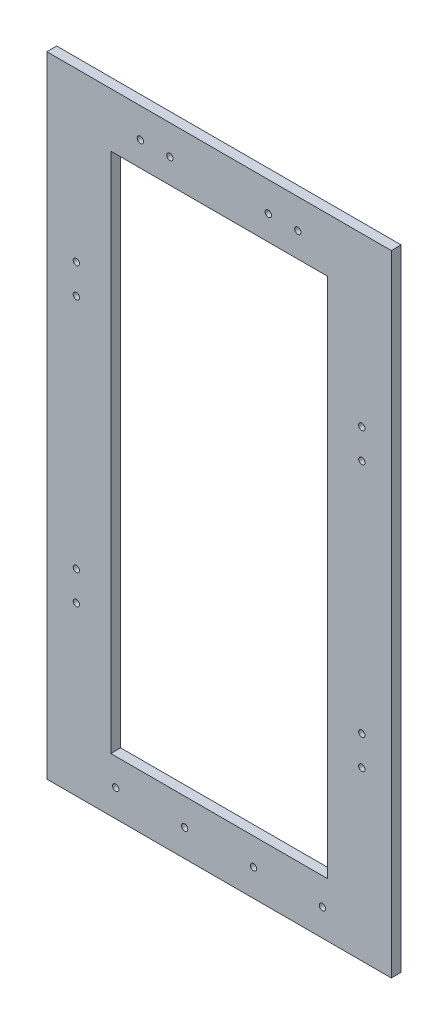
ISO-10303-21;
HEADER;
FILE_DESCRIPTION(('STEP AP214'),'2;1');
FILE_NAME('part.step','',(''),(''),'','','');
FILE_SCHEMA(('AUTOMOTIVE_DESIGN { 1 0 10303 214 1 1 1 1 }'));
ENDSEC;
DATA;
#1=APPLICATION_CONTEXT('core data for automotive mechanical design processes');
#2=APPLICATION_PROTOCOL_DEFINITION('international standard','automotive_design',2000,#1);
#3=PRODUCT_CONTEXT('',#1,'mechanical');
#4=PRODUCT('Part','Part','',(#3));
#5=PRODUCT_RELATED_PRODUCT_CATEGORY('part','',(#4));
#6=PRODUCT_DEFINITION_FORMATION('','',#4);
#7=PRODUCT_DEFINITION_CONTEXT('part definition',#1,'design');
#8=PRODUCT_DEFINITION('design','',#6,#7);
#9=PRODUCT_DEFINITION_SHAPE('','',#8);
#10=(LENGTH_UNIT() NAMED_UNIT(*) SI_UNIT(.MILLI.,.METRE.));
#11=(NAMED_UNIT(*) PLANE_ANGLE_UNIT() SI_UNIT($,.RADIAN.));
#12=(NAMED_UNIT(*) SI_UNIT($,.STERADIAN.) SOLID_ANGLE_UNIT());
#13=UNCERTAINTY_MEASURE_WITH_UNIT(LENGTH_MEASURE(1.E-05),#10,'distance_accuracy_value','');
#14=(GEOMETRIC_REPRESENTATION_CONTEXT(3) GLOBAL_UNCERTAINTY_ASSIGNED_CONTEXT((#13)) GLOBAL_UNIT_ASSIGNED_CONTEXT((#10,
#11,#12)) REPRESENTATION_CONTEXT('',''));
#15=CARTESIAN_POINT('',(0.,0.,0.));
#16=DIRECTION('',(0.,0.,1.));
#17=DIRECTION('',(1.,0.,0.));
#18=AXIS2_PLACEMENT_3D('',#15,#16,#17);
#19=CARTESIAN_POINT('',(87.5,-160.,5.));
#20=DIRECTION('',(-1.,0.,0.));
#21=DIRECTION('',(0.,0.,1.));
#22=AXIS2_PLACEMENT_3D('',#19,#20,#21);
#23=PLANE('',#22);
#24=DIRECTION('',(0.,1.,0.));
#25=VECTOR('',#24,1.);
#26=CARTESIAN_POINT('',(87.5,-160.,0.));
#27=LINE('',#26,#25);
#28=CARTESIAN_POINT('',(87.5,-160.,0.));
#29=VERTEX_POINT('',#28);
#30=CARTESIAN_POINT('',(87.5,160.,0.));
#31=VERTEX_POINT('',#30);
#32=EDGE_CURVE('E113',#29,#31,#27,.T.);
#33=ORIENTED_EDGE('',*,*,#32,.T.);
#34=DIRECTION('',(0.,0.,-1.));
#35=VECTOR('',#34,1.);
#36=CARTESIAN_POINT('',(87.5,160.,5.));
#37=LINE('',#36,#35);
#38=CARTESIAN_POINT('',(87.5,160.,5.));
#39=VERTEX_POINT('',#38);
#40=EDGE_CURVE('E11',#39,#31,#37,.T.);
#41=ORIENTED_EDGE('',*,*,#40,.F.);
#42=DIRECTION('',(0.,1.,0.));
#43=VECTOR('',#42,1.);
#44=CARTESIAN_POINT('',(87.5,-160.,5.));
#45=LINE('',#44,#43);
#46=CARTESIAN_POINT('',(87.5,-160.,5.));
#47=VERTEX_POINT('',#46);
#48=EDGE_CURVE('E136',#47,#39,#45,.T.);
#49=ORIENTED_EDGE('',*,*,#48,.F.);
#50=DIRECTION('',(0.,0.,-1.));
#51=VECTOR('',#50,1.);
#52=CARTESIAN_POINT('',(87.5,-160.,5.));
#53=LINE('',#52,#51);
#54=EDGE_CURVE('E146',#47,#29,#53,.T.);
#55=ORIENTED_EDGE('',*,*,#54,.T.);
#56=EDGE_LOOP('',(#33,#41,#49,#55));
#57=FACE_BOUND('',#56,.T.);
#58=ADVANCED_FACE('F33',(#57),#23,.F.);
#59=CARTESIAN_POINT('',(-87.5,160.,5.));
#60=DIRECTION('',(0.,-1.,0.));
#61=DIRECTION('',(0.,0.,-1.));
#62=AXIS2_PLACEMENT_3D('',#59,#60,#61);
#63=PLANE('',#62);
#64=DIRECTION('',(-1.,0.,0.));
#65=VECTOR('',#64,1.);
#66=CARTESIAN_POINT('',(-87.5,160.,0.));
#67=LINE('',#66,#65);
#68=CARTESIAN_POINT('',(-87.5,160.,0.));
#69=VERTEX_POINT('',#68);
#70=EDGE_CURVE('E149',#31,#69,#67,.T.);
#71=ORIENTED_EDGE('',*,*,#70,.T.);
#72=DIRECTION('',(0.,0.,-1.));
#73=VECTOR('',#72,1.);
#74=CARTESIAN_POINT('',(-87.5,160.,5.));
#75=LINE('',#74,#73);
#76=CARTESIAN_POINT('',(-87.5,160.,5.));
#77=VERTEX_POINT('',#76);
#78=EDGE_CURVE('E41',#77,#69,#75,.T.);
#79=ORIENTED_EDGE('',*,*,#78,.F.);
#80=DIRECTION('',(-1.,0.,0.));
#81=VECTOR('',#80,1.);
#82=CARTESIAN_POINT('',(-87.5,160.,5.));
#83=LINE('',#82,#81);
#84=EDGE_CURVE('E139',#39,#77,#83,.T.);
#85=ORIENTED_EDGE('',*,*,#84,.F.);
#86=ORIENTED_EDGE('',*,*,#40,.T.);
#87=EDGE_LOOP('',(#71,#79,#85,#86));
#88=FACE_BOUND('',#87,.T.);
#89=ADVANCED_FACE('F263',(#88),#63,.F.);
#90=CARTESIAN_POINT('',(-87.5,-160.,5.));
#91=DIRECTION('',(1.,0.,0.));
#92=DIRECTION('',(0.,0.,-1.));
#93=AXIS2_PLACEMENT_3D('',#90,#91,#92);
#94=PLANE('',#93);
#95=DIRECTION('',(0.,-1.,0.));
#96=VECTOR('',#95,1.);
#97=CARTESIAN_POINT('',(-87.5,-160.,0.));
#98=LINE('',#97,#96);
#99=CARTESIAN_POINT('',(-87.5,-160.,0.));
#100=VERTEX_POINT('',#99);
#101=EDGE_CURVE('E151',#69,#100,#98,.T.);
#102=ORIENTED_EDGE('',*,*,#101,.T.);
#103=DIRECTION('',(0.,0.,-1.));
#104=VECTOR('',#103,1.);
#105=CARTESIAN_POINT('',(-87.5,-160.,5.));
#106=LINE('',#105,#104);
#107=CARTESIAN_POINT('',(-87.5,-160.,5.));
#108=VERTEX_POINT('',#107);
#109=EDGE_CURVE('E156',#108,#100,#106,.T.);
#110=ORIENTED_EDGE('',*,*,#109,.F.);
#111=DIRECTION('',(0.,-1.,0.));
#112=VECTOR('',#111,1.);
#113=CARTESIAN_POINT('',(-87.5,-160.,5.));
#114=LINE('',#113,#112);
#115=EDGE_CURVE('E142',#77,#108,#114,.T.);
#116=ORIENTED_EDGE('',*,*,#115,.F.);
#117=ORIENTED_EDGE('',*,*,#78,.T.);
#118=EDGE_LOOP('',(#102,#110,#116,#117));
#119=FACE_BOUND('',#118,.T.);
#120=ADVANCED_FACE('F256',(#119),#94,.F.);
#121=CARTESIAN_POINT('',(-87.5,-160.,5.));
#122=DIRECTION('',(0.,1.,0.));
#123=DIRECTION('',(0.,0.,1.));
#124=AXIS2_PLACEMENT_3D('',#121,#122,#123);
#125=PLANE('',#124);
#126=DIRECTION('',(1.,0.,0.));
#127=VECTOR('',#126,1.);
#128=CARTESIAN_POINT('',(-87.5,-160.,0.));
#129=LINE('',#128,#127);
#130=EDGE_CURVE('E140',#100,#29,#129,.T.);
#131=ORIENTED_EDGE('',*,*,#130,.T.);
#132=ORIENTED_EDGE('',*,*,#54,.F.);
#133=DIRECTION('',(1.,0.,0.));
#134=VECTOR('',#133,1.);
#135=CARTESIAN_POINT('',(-87.5,-160.,5.));
#136=LINE('',#135,#134);
#137=EDGE_CURVE('E144',#108,#47,#136,.T.);
#138=ORIENTED_EDGE('',*,*,#137,.F.);
#139=ORIENTED_EDGE('',*,*,#109,.T.);
#140=EDGE_LOOP('',(#131,#132,#138,#139));
#141=FACE_BOUND('',#140,.T.);
#142=ADVANCED_FACE('F247',(#141),#125,.F.);
#143=CARTESIAN_POINT('',(0.,0.,5.));
#144=DIRECTION('',(0.,0.,-1.));
#145=DIRECTION('',(-1.,0.,0.));
#146=AXIS2_PLACEMENT_3D('',#143,#144,#145);
#147=PLANE('',#146);
#148=CARTESIAN_POINT('',(-52.5,-146.25,5.));
#149=DIRECTION('',(0.,0.,-1.));
#150=DIRECTION('',(-1.,0.,0.));
#151=AXIS2_PLACEMENT_3D('',#148,#149,#150);
#152=CIRCLE('',#151,1.6);
#153=CARTESIAN_POINT('',(-54.1,-146.25,5.));
#154=VERTEX_POINT('',#153);
#155=EDGE_CURVE('E165',#154,#154,#152,.F.);
#156=ORIENTED_EDGE('',*,*,#155,.F.);
#157=EDGE_LOOP('',(#156));
#158=FACE_BOUND('',#157,.T.);
#159=CARTESIAN_POINT('',(-17.5,-146.25,5.));
#160=DIRECTION('',(0.,0.,-1.));
#161=DIRECTION('',(-1.,0.,0.));
#162=AXIS2_PLACEMENT_3D('',#159,#160,#161);
#163=CIRCLE('',#162,1.6);
#164=CARTESIAN_POINT('',(-19.1,-146.25,5.));
#165=VERTEX_POINT('',#164);
#166=EDGE_CURVE('E496',#165,#165,#163,.F.);
#167=ORIENTED_EDGE('',*,*,#166,.F.);
#168=EDGE_LOOP('',(#167));
#169=FACE_BOUND('',#168,.T.);
#170=CARTESIAN_POINT('',(17.5,-146.250000000001,5.));
#171=DIRECTION('',(0.,0.,-1.));
#172=DIRECTION('',(-1.,0.,0.));
#173=AXIS2_PLACEMENT_3D('',#170,#171,#172);
#174=CIRCLE('',#173,1.6);
#175=CARTESIAN_POINT('',(15.9,-146.250000000001,5.));
#176=VERTEX_POINT('',#175);
#177=EDGE_CURVE('E499',#176,#176,#174,.F.);
#178=ORIENTED_EDGE('',*,*,#177,.F.);
#179=EDGE_LOOP('',(#178));
#180=FACE_BOUND('',#179,.T.);
#181=CARTESIAN_POINT('',(52.5,-146.250000000001,5.));
#182=DIRECTION('',(0.,0.,-1.));
#183=DIRECTION('',(-1.,0.,0.));
#184=AXIS2_PLACEMENT_3D('',#181,#182,#183);
#185=CIRCLE('',#184,1.6);
#186=CARTESIAN_POINT('',(50.9,-146.250000000001,5.));
#187=VERTEX_POINT('',#186);
#188=EDGE_CURVE('E504',#187,#187,#185,.F.);
#189=ORIENTED_EDGE('',*,*,#188,.F.);
#190=EDGE_LOOP('',(#189));
#191=FACE_BOUND('',#190,.T.);
#192=CARTESIAN_POINT('',(-72.5,-75.,5.));
#193=DIRECTION('',(0.,0.,-1.));
#194=DIRECTION('',(-1.,0.,0.));
#195=AXIS2_PLACEMENT_3D('',#192,#193,#194);
#196=CIRCLE('',#195,1.60000000000001);
#197=CARTESIAN_POINT('',(-74.1,-75.,5.));
#198=VERTEX_POINT('',#197);
#199=EDGE_CURVE('E191',#198,#198,#196,.F.);
#200=ORIENTED_EDGE('',*,*,#199,.F.);
#201=EDGE_LOOP('',(#200));
#202=FACE_BOUND('',#201,.T.);
#203=CARTESIAN_POINT('',(72.5,-60.,5.));
#204=DIRECTION('',(0.,0.,-1.));
#205=DIRECTION('',(-1.,0.,0.));
#206=AXIS2_PLACEMENT_3D('',#203,#204,#205);
#207=CIRCLE('',#206,1.60000000000001);
#208=CARTESIAN_POINT('',(70.9,-60.,5.));
#209=VERTEX_POINT('',#208);
#210=EDGE_CURVE('E190',#209,#209,#207,.F.);
#211=ORIENTED_EDGE('',*,*,#210,.F.);
#212=EDGE_LOOP('',(#211));
#213=FACE_BOUND('',#212,.T.);
#214=CARTESIAN_POINT('',(72.5,-75.,5.));
#215=DIRECTION('',(0.,0.,-1.));
#216=DIRECTION('',(-1.,0.,0.));
#217=AXIS2_PLACEMENT_3D('',#214,#215,#216);
#218=CIRCLE('',#217,1.60000000000001);
#219=CARTESIAN_POINT('',(70.9,-75.,5.));
#220=VERTEX_POINT('',#219);
#221=EDGE_CURVE('E205',#220,#220,#218,.F.);
#222=ORIENTED_EDGE('',*,*,#221,.F.);
#223=EDGE_LOOP('',(#222));
#224=FACE_BOUND('',#223,.T.);
#225=CARTESIAN_POINT('',(72.5,60.,5.));
#226=DIRECTION('',(0.,0.,-1.));
#227=DIRECTION('',(-1.,0.,0.));
#228=AXIS2_PLACEMENT_3D('',#225,#226,#227);
#229=CIRCLE('',#228,1.60000000000001);
#230=CARTESIAN_POINT('',(70.9,60.,5.));
#231=VERTEX_POINT('',#230);
#232=EDGE_CURVE('E204',#231,#231,#229,.F.);
#233=ORIENTED_EDGE('',*,*,#232,.F.);
#234=EDGE_LOOP('',(#233));
#235=FACE_BOUND('',#234,.T.);
#236=CARTESIAN_POINT('',(-72.5,-60.,5.));
#237=DIRECTION('',(0.,0.,-1.));
#238=DIRECTION('',(-1.,0.,0.));
#239=AXIS2_PLACEMENT_3D('',#236,#237,#238);
#240=CIRCLE('',#239,1.60000000000001);
#241=CARTESIAN_POINT('',(-74.1,-60.,5.));
#242=VERTEX_POINT('',#241);
#243=EDGE_CURVE('E198',#242,#242,#240,.F.);
#244=ORIENTED_EDGE('',*,*,#243,.F.);
#245=EDGE_LOOP('',(#244));
#246=FACE_BOUND('',#245,.T.);
#247=CARTESIAN_POINT('',(-72.5,60.,5.));
#248=DIRECTION('',(0.,0.,-1.));
#249=DIRECTION('',(-1.,0.,0.));
#250=AXIS2_PLACEMENT_3D('',#247,#248,#249);
#251=CIRCLE('',#250,1.60000000000001);
#252=CARTESIAN_POINT('',(-74.1,60.,5.));
#253=VERTEX_POINT('',#252);
#254=EDGE_CURVE('E184',#253,#253,#251,.F.);
#255=ORIENTED_EDGE('',*,*,#254,.F.);
#256=EDGE_LOOP('',(#255));
#257=FACE_BOUND('',#256,.T.);
#258=CARTESIAN_POINT('',(-72.5,75.,5.));
#259=DIRECTION('',(0.,0.,-1.));
#260=DIRECTION('',(-1.,0.,0.));
#261=AXIS2_PLACEMENT_3D('',#258,#259,#260);
#262=CIRCLE('',#261,1.60000000000001);
#263=CARTESIAN_POINT('',(-74.1,75.,5.));
#264=VERTEX_POINT('',#263);
#265=EDGE_CURVE('E176',#264,#264,#262,.F.);
#266=ORIENTED_EDGE('',*,*,#265,.F.);
#267=EDGE_LOOP('',(#266));
#268=FACE_BOUND('',#267,.T.);
#269=CARTESIAN_POINT('',(72.5,75.,5.));
#270=DIRECTION('',(0.,0.,-1.));
#271=DIRECTION('',(-1.,0.,0.));
#272=AXIS2_PLACEMENT_3D('',#269,#270,#271);
#273=CIRCLE('',#272,1.60000000000001);
#274=CARTESIAN_POINT('',(70.9,75.,5.));
#275=VERTEX_POINT('',#274);
#276=EDGE_CURVE('E215',#275,#275,#273,.F.);
#277=ORIENTED_EDGE('',*,*,#276,.F.);
#278=EDGE_LOOP('',(#277));
#279=FACE_BOUND('',#278,.T.);
#280=CARTESIAN_POINT('',(-40.,145.,5.));
#281=DIRECTION('',(0.,0.,-1.));
#282=DIRECTION('',(-1.,0.,0.));
#283=AXIS2_PLACEMENT_3D('',#280,#281,#282);
#284=CIRCLE('',#283,1.6);
#285=CARTESIAN_POINT('',(-41.6,145.,5.));
#286=VERTEX_POINT('',#285);
#287=EDGE_CURVE('E230',#286,#286,#284,.F.);
#288=ORIENTED_EDGE('',*,*,#287,.F.);
#289=EDGE_LOOP('',(#288));
#290=FACE_BOUND('',#289,.T.);
#291=CARTESIAN_POINT('',(-25.,145.,5.));
#292=DIRECTION('',(0.,0.,-1.));
#293=DIRECTION('',(-1.,0.,0.));
#294=AXIS2_PLACEMENT_3D('',#291,#292,#293);
#295=CIRCLE('',#294,1.60000000000001);
#296=CARTESIAN_POINT('',(-26.6,145.,5.));
#297=VERTEX_POINT('',#296);
#298=EDGE_CURVE('E223',#297,#297,#295,.F.);
#299=ORIENTED_EDGE('',*,*,#298,.F.);
#300=EDGE_LOOP('',(#299));
#301=FACE_BOUND('',#300,.T.);
#302=CARTESIAN_POINT('',(40.,145.,5.));
#303=DIRECTION('',(0.,0.,-1.));
#304=DIRECTION('',(-1.,0.,0.));
#305=AXIS2_PLACEMENT_3D('',#302,#303,#304);
#306=CIRCLE('',#305,1.6);
#307=CARTESIAN_POINT('',(38.4,145.,5.));
#308=VERTEX_POINT('',#307);
#309=EDGE_CURVE('E222',#308,#308,#306,.F.);
#310=ORIENTED_EDGE('',*,*,#309,.F.);
#311=EDGE_LOOP('',(#310));
#312=FACE_BOUND('',#311,.T.);
#313=CARTESIAN_POINT('',(25.,145.,5.));
#314=DIRECTION('',(0.,0.,-1.));
#315=DIRECTION('',(-1.,0.,0.));
#316=AXIS2_PLACEMENT_3D('',#313,#314,#315);
#317=CIRCLE('',#316,1.6);
#318=CARTESIAN_POINT('',(23.4,145.,5.));
#319=VERTEX_POINT('',#318);
#320=EDGE_CURVE('E239',#319,#319,#317,.F.);
#321=ORIENTED_EDGE('',*,*,#320,.F.);
#322=EDGE_LOOP('',(#321));
#323=FACE_BOUND('',#322,.T.);
#324=DIRECTION('',(-1.,0.,0.));
#325=VECTOR('',#324,1.);
#326=CARTESIAN_POINT('',(-55.,132.5,5.));
#327=LINE('',#326,#325);
#328=CARTESIAN_POINT('',(55.,132.5,5.));
#329=VERTEX_POINT('',#328);
#330=CARTESIAN_POINT('',(-55.,132.5,5.));
#331=VERTEX_POINT('',#330);
#332=EDGE_CURVE('E119',#329,#331,#327,.T.);
#333=ORIENTED_EDGE('',*,*,#332,.F.);
#334=DIRECTION('',(0.,1.,0.));
#335=VECTOR('',#334,1.);
#336=CARTESIAN_POINT('',(55.,-132.5,5.));
#337=LINE('',#336,#335);
#338=CARTESIAN_POINT('',(55.,-132.5,5.));
#339=VERTEX_POINT('',#338);
#340=EDGE_CURVE('E101',#339,#329,#337,.T.);
#341=ORIENTED_EDGE('',*,*,#340,.F.);
#342=DIRECTION('',(1.,0.,0.));
#343=VECTOR('',#342,1.);
#344=CARTESIAN_POINT('',(-55.,-132.5,5.));
#345=LINE('',#344,#343);
#346=CARTESIAN_POINT('',(-55.,-132.5,5.));
#347=VERTEX_POINT('',#346);
#348=EDGE_CURVE('E110',#347,#339,#345,.T.);
#349=ORIENTED_EDGE('',*,*,#348,.F.);
#350=DIRECTION('',(0.,-1.,0.));
#351=VECTOR('',#350,1.);
#352=CARTESIAN_POINT('',(-55.,-132.5,5.));
#353=LINE('',#352,#351);
#354=EDGE_CURVE('E49',#331,#347,#353,.T.);
#355=ORIENTED_EDGE('',*,*,#354,.F.);
#356=EDGE_LOOP('',(#333,#341,#349,#355));
#357=FACE_BOUND('',#356,.T.);
#358=ORIENTED_EDGE('',*,*,#48,.T.);
#359=ORIENTED_EDGE('',*,*,#84,.T.);
#360=ORIENTED_EDGE('',*,*,#115,.T.);
#361=ORIENTED_EDGE('',*,*,#137,.T.);
#362=EDGE_LOOP('',(#358,#359,#360,#361));
#363=FACE_BOUND('',#362,.T.);
#364=ADVANCED_FACE('F116',(#158,#169,#180,#191,#202,#213,#224,#235,#246,#257,#268,#279,#290,
#301,#312,#323,#357,#363),#147,.F.);
#365=CARTESIAN_POINT('',(0.,0.,0.));
#366=DIRECTION('',(0.,0.,-1.));
#367=DIRECTION('',(-1.,0.,0.));
#368=AXIS2_PLACEMENT_3D('',#365,#366,#367);
#369=PLANE('',#368);
#370=CARTESIAN_POINT('',(-52.5,-146.25,0.));
#371=DIRECTION('',(0.,0.,-1.));
#372=DIRECTION('',(-1.,0.,0.));
#373=AXIS2_PLACEMENT_3D('',#370,#371,#372);
#374=CIRCLE('',#373,1.6);
#375=CARTESIAN_POINT('',(-54.1,-146.25,0.));
#376=VERTEX_POINT('',#375);
#377=EDGE_CURVE('E36',#376,#376,#374,.F.);
#378=ORIENTED_EDGE('',*,*,#377,.T.);
#379=EDGE_LOOP('',(#378));
#380=FACE_BOUND('',#379,.T.);
#381=CARTESIAN_POINT('',(-17.5,-146.25,0.));
#382=DIRECTION('',(0.,0.,-1.));
#383=DIRECTION('',(-1.,0.,0.));
#384=AXIS2_PLACEMENT_3D('',#381,#382,#383);
#385=CIRCLE('',#384,1.6);
#386=CARTESIAN_POINT('',(-19.1,-146.25,0.));
#387=VERTEX_POINT('',#386);
#388=EDGE_CURVE('E167',#387,#387,#385,.F.);
#389=ORIENTED_EDGE('',*,*,#388,.T.);
#390=EDGE_LOOP('',(#389));
#391=FACE_BOUND('',#390,.T.);
#392=CARTESIAN_POINT('',(17.5,-146.250000000001,0.));
#393=DIRECTION('',(0.,0.,-1.));
#394=DIRECTION('',(-1.,0.,0.));
#395=AXIS2_PLACEMENT_3D('',#392,#393,#394);
#396=CIRCLE('',#395,1.6);
#397=CARTESIAN_POINT('',(15.9,-146.250000000001,0.));
#398=VERTEX_POINT('',#397);
#399=EDGE_CURVE('E164',#398,#398,#396,.F.);
#400=ORIENTED_EDGE('',*,*,#399,.T.);
#401=EDGE_LOOP('',(#400));
#402=FACE_BOUND('',#401,.T.);
#403=CARTESIAN_POINT('',(52.5,-146.250000000001,0.));
#404=DIRECTION('',(0.,0.,-1.));
#405=DIRECTION('',(-1.,0.,0.));
#406=AXIS2_PLACEMENT_3D('',#403,#404,#405);
#407=CIRCLE('',#406,1.6);
#408=CARTESIAN_POINT('',(50.9,-146.250000000001,0.));
#409=VERTEX_POINT('',#408);
#410=EDGE_CURVE('E161',#409,#409,#407,.F.);
#411=ORIENTED_EDGE('',*,*,#410,.T.);
#412=EDGE_LOOP('',(#411));
#413=FACE_BOUND('',#412,.T.);
#414=CARTESIAN_POINT('',(-72.5,-75.,0.));
#415=DIRECTION('',(0.,0.,-1.));
#416=DIRECTION('',(-1.,0.,0.));
#417=AXIS2_PLACEMENT_3D('',#414,#415,#416);
#418=CIRCLE('',#417,1.60000000000001);
#419=CARTESIAN_POINT('',(-74.1,-75.,0.));
#420=VERTEX_POINT('',#419);
#421=EDGE_CURVE('E195',#420,#420,#418,.T.);
#422=ORIENTED_EDGE('',*,*,#421,.F.);
#423=EDGE_LOOP('',(#422));
#424=FACE_BOUND('',#423,.T.);
#425=CARTESIAN_POINT('',(72.5,-60.,0.));
#426=DIRECTION('',(0.,0.,-1.));
#427=DIRECTION('',(1.,0.,0.));
#428=AXIS2_PLACEMENT_3D('',#425,#426,#427);
#429=CIRCLE('',#428,1.60000000000001);
#430=CARTESIAN_POINT('',(74.1,-60.,0.));
#431=VERTEX_POINT('',#430);
#432=EDGE_CURVE('E187',#431,#431,#429,.T.);
#433=ORIENTED_EDGE('',*,*,#432,.F.);
#434=EDGE_LOOP('',(#433));
#435=FACE_BOUND('',#434,.T.);
#436=CARTESIAN_POINT('',(72.5,-75.,0.));
#437=DIRECTION('',(0.,0.,-1.));
#438=DIRECTION('',(1.,0.,0.));
#439=AXIS2_PLACEMENT_3D('',#436,#437,#438);
#440=CIRCLE('',#439,1.60000000000001);
#441=CARTESIAN_POINT('',(74.1,-75.,0.));
#442=VERTEX_POINT('',#441);
#443=EDGE_CURVE('E194',#442,#442,#440,.T.);
#444=ORIENTED_EDGE('',*,*,#443,.F.);
#445=EDGE_LOOP('',(#444));
#446=FACE_BOUND('',#445,.T.);
#447=CARTESIAN_POINT('',(72.5,60.,0.));
#448=DIRECTION('',(0.,0.,-1.));
#449=DIRECTION('',(-1.,0.,0.));
#450=AXIS2_PLACEMENT_3D('',#447,#448,#449);
#451=CIRCLE('',#450,1.60000000000001);
#452=CARTESIAN_POINT('',(70.9,60.,0.));
#453=VERTEX_POINT('',#452);
#454=EDGE_CURVE('E201',#453,#453,#451,.T.);
#455=ORIENTED_EDGE('',*,*,#454,.F.);
#456=EDGE_LOOP('',(#455));
#457=FACE_BOUND('',#456,.T.);
#458=CARTESIAN_POINT('',(-72.5,-60.,0.));
#459=DIRECTION('',(0.,0.,-1.));
#460=DIRECTION('',(-1.,0.,0.));
#461=AXIS2_PLACEMENT_3D('',#458,#459,#460);
#462=CIRCLE('',#461,1.60000000000001);
#463=CARTESIAN_POINT('',(-74.1,-60.,0.));
#464=VERTEX_POINT('',#463);
#465=EDGE_CURVE('E507',#464,#464,#462,.T.);
#466=ORIENTED_EDGE('',*,*,#465,.F.);
#467=EDGE_LOOP('',(#466));
#468=FACE_BOUND('',#467,.T.);
#469=CARTESIAN_POINT('',(-72.5,60.,0.));
#470=DIRECTION('',(0.,0.,-1.));
#471=DIRECTION('',(1.,0.,0.));
#472=AXIS2_PLACEMENT_3D('',#469,#470,#471);
#473=CIRCLE('',#472,1.60000000000001);
#474=CARTESIAN_POINT('',(-70.9,60.,0.));
#475=VERTEX_POINT('',#474);
#476=EDGE_CURVE('E181',#475,#475,#473,.T.);
#477=ORIENTED_EDGE('',*,*,#476,.F.);
#478=EDGE_LOOP('',(#477));
#479=FACE_BOUND('',#478,.T.);
#480=CARTESIAN_POINT('',(-72.5,75.,0.));
#481=DIRECTION('',(0.,0.,-1.));
#482=DIRECTION('',(1.,0.,0.));
#483=AXIS2_PLACEMENT_3D('',#480,#481,#482);
#484=CIRCLE('',#483,1.60000000000001);
#485=CARTESIAN_POINT('',(-70.9,75.,0.));
#486=VERTEX_POINT('',#485);
#487=EDGE_CURVE('E172',#486,#486,#484,.T.);
#488=ORIENTED_EDGE('',*,*,#487,.F.);
#489=EDGE_LOOP('',(#488));
#490=FACE_BOUND('',#489,.T.);
#491=CARTESIAN_POINT('',(72.5,75.,0.));
#492=DIRECTION('',(0.,0.,-1.));
#493=DIRECTION('',(-1.,0.,0.));
#494=AXIS2_PLACEMENT_3D('',#491,#492,#493);
#495=CIRCLE('',#494,1.60000000000001);
#496=CARTESIAN_POINT('',(70.9,75.,0.));
#497=VERTEX_POINT('',#496);
#498=EDGE_CURVE('E208',#497,#497,#495,.T.);
#499=ORIENTED_EDGE('',*,*,#498,.F.);
#500=EDGE_LOOP('',(#499));
#501=FACE_BOUND('',#500,.T.);
#502=CARTESIAN_POINT('',(-40.,145.,0.));
#503=DIRECTION('',(0.,0.,-1.));
#504=DIRECTION('',(1.,0.,0.));
#505=AXIS2_PLACEMENT_3D('',#502,#503,#504);
#506=CIRCLE('',#505,1.6);
#507=CARTESIAN_POINT('',(-38.4,145.,0.));
#508=VERTEX_POINT('',#507);
#509=EDGE_CURVE('E218',#508,#508,#506,.T.);
#510=ORIENTED_EDGE('',*,*,#509,.F.);
#511=EDGE_LOOP('',(#510));
#512=FACE_BOUND('',#511,.T.);
#513=CARTESIAN_POINT('',(-25.,145.,0.));
#514=DIRECTION('',(0.,0.,-1.));
#515=DIRECTION('',(1.,0.,0.));
#516=AXIS2_PLACEMENT_3D('',#513,#514,#515);
#517=CIRCLE('',#516,1.60000000000001);
#518=CARTESIAN_POINT('',(-23.4,145.,0.));
#519=VERTEX_POINT('',#518);
#520=EDGE_CURVE('E227',#519,#519,#517,.T.);
#521=ORIENTED_EDGE('',*,*,#520,.F.);
#522=EDGE_LOOP('',(#521));
#523=FACE_BOUND('',#522,.T.);
#524=CARTESIAN_POINT('',(40.,145.,0.));
#525=DIRECTION('',(0.,0.,-1.));
#526=DIRECTION('',(-1.,0.,0.));
#527=AXIS2_PLACEMENT_3D('',#524,#525,#526);
#528=CIRCLE('',#527,1.6);
#529=CARTESIAN_POINT('',(38.4,145.,0.));
#530=VERTEX_POINT('',#529);
#531=EDGE_CURVE('E219',#530,#530,#528,.T.);
#532=ORIENTED_EDGE('',*,*,#531,.F.);
#533=EDGE_LOOP('',(#532));
#534=FACE_BOUND('',#533,.T.);
#535=CARTESIAN_POINT('',(25.,145.,0.));
#536=DIRECTION('',(0.,0.,-1.));
#537=DIRECTION('',(-1.,0.,0.));
#538=AXIS2_PLACEMENT_3D('',#535,#536,#537);
#539=CIRCLE('',#538,1.6);
#540=CARTESIAN_POINT('',(23.4,145.,0.));
#541=VERTEX_POINT('',#540);
#542=EDGE_CURVE('E226',#541,#541,#539,.T.);
#543=ORIENTED_EDGE('',*,*,#542,.F.);
#544=EDGE_LOOP('',(#543));
#545=FACE_BOUND('',#544,.T.);
#546=DIRECTION('',(0.,-1.,0.));
#547=VECTOR('',#546,1.);
#548=CARTESIAN_POINT('',(55.,-132.5,0.));
#549=LINE('',#548,#547);
#550=CARTESIAN_POINT('',(55.,132.5,0.));
#551=VERTEX_POINT('',#550);
#552=CARTESIAN_POINT('',(55.,-132.5,0.));
#553=VERTEX_POINT('',#552);
#554=EDGE_CURVE('E57',#551,#553,#549,.T.);
#555=ORIENTED_EDGE('',*,*,#554,.F.);
#556=DIRECTION('',(1.,0.,0.));
#557=VECTOR('',#556,1.);
#558=CARTESIAN_POINT('',(-55.,132.5,0.));
#559=LINE('',#558,#557);
#560=CARTESIAN_POINT('',(-55.,132.5,0.));
#561=VERTEX_POINT('',#560);
#562=EDGE_CURVE('E107',#561,#551,#559,.T.);
#563=ORIENTED_EDGE('',*,*,#562,.F.);
#564=DIRECTION('',(0.,1.,0.));
#565=VECTOR('',#564,1.);
#566=CARTESIAN_POINT('',(-55.,-132.5,0.));
#567=LINE('',#566,#565);
#568=CARTESIAN_POINT('',(-55.,-132.5,0.));
#569=VERTEX_POINT('',#568);
#570=EDGE_CURVE('E127',#569,#561,#567,.T.);
#571=ORIENTED_EDGE('',*,*,#570,.F.);
#572=DIRECTION('',(-1.,0.,0.));
#573=VECTOR('',#572,1.);
#574=CARTESIAN_POINT('',(-55.,-132.5,0.));
#575=LINE('',#574,#573);
#576=EDGE_CURVE('E121',#553,#569,#575,.T.);
#577=ORIENTED_EDGE('',*,*,#576,.F.);
#578=EDGE_LOOP('',(#555,#563,#571,#577));
#579=FACE_BOUND('',#578,.T.);
#580=ORIENTED_EDGE('',*,*,#32,.F.);
#581=ORIENTED_EDGE('',*,*,#130,.F.);
#582=ORIENTED_EDGE('',*,*,#101,.F.);
#583=ORIENTED_EDGE('',*,*,#70,.F.);
#584=EDGE_LOOP('',(#580,#581,#582,#583));
#585=FACE_BOUND('',#584,.T.);
#586=ADVANCED_FACE('F246',(#380,#391,#402,#413,#424,#435,#446,#457,#468,#479,#490,#501,#512,
#523,#534,#545,#579,#585),#369,.T.);
#587=CARTESIAN_POINT('',(55.,-132.5,5.001));
#588=DIRECTION('',(1.,0.,0.));
#589=DIRECTION('',(0.,0.,-1.));
#590=AXIS2_PLACEMENT_3D('',#587,#588,#589);
#591=PLANE('',#590);
#592=ORIENTED_EDGE('',*,*,#340,.T.);
#593=DIRECTION('',(0.,0.,-1.));
#594=VECTOR('',#593,1.);
#595=CARTESIAN_POINT('',(55.,132.5,5.001));
#596=LINE('',#595,#594);
#597=EDGE_CURVE('E114',#329,#551,#596,.T.);
#598=ORIENTED_EDGE('',*,*,#597,.T.);
#599=ORIENTED_EDGE('',*,*,#554,.T.);
#600=DIRECTION('',(0.,0.,-1.));
#601=VECTOR('',#600,1.);
#602=CARTESIAN_POINT('',(55.,-132.5,5.001));
#603=LINE('',#602,#601);
#604=EDGE_CURVE('E97',#339,#553,#603,.T.);
#605=ORIENTED_EDGE('',*,*,#604,.F.);
#606=EDGE_LOOP('',(#592,#598,#599,#605));
#607=FACE_BOUND('',#606,.T.);
#608=ADVANCED_FACE('F99',(#607),#591,.F.);
#609=CARTESIAN_POINT('',(-55.,132.5,5.001));
#610=DIRECTION('',(0.,1.,0.));
#611=DIRECTION('',(-1.,0.,0.));
#612=AXIS2_PLACEMENT_3D('',#609,#610,#611);
#613=PLANE('',#612);
#614=ORIENTED_EDGE('',*,*,#332,.T.);
#615=DIRECTION('',(0.,0.,-1.));
#616=VECTOR('',#615,1.);
#617=CARTESIAN_POINT('',(-55.,132.5,5.001));
#618=LINE('',#617,#616);
#619=EDGE_CURVE('E133',#331,#561,#618,.T.);
#620=ORIENTED_EDGE('',*,*,#619,.T.);
#621=ORIENTED_EDGE('',*,*,#562,.T.);
#622=ORIENTED_EDGE('',*,*,#597,.F.);
#623=EDGE_LOOP('',(#614,#620,#621,#622));
#624=FACE_BOUND('',#623,.T.);
#625=ADVANCED_FACE('F309',(#624),#613,.F.);
#626=CARTESIAN_POINT('',(-55.,-132.5,5.001));
#627=DIRECTION('',(-1.,0.,0.));
#628=DIRECTION('',(0.,0.,1.));
#629=AXIS2_PLACEMENT_3D('',#626,#627,#628);
#630=PLANE('',#629);
#631=ORIENTED_EDGE('',*,*,#354,.T.);
#632=DIRECTION('',(0.,0.,-1.));
#633=VECTOR('',#632,1.);
#634=CARTESIAN_POINT('',(-55.,-132.5,5.001));
#635=LINE('',#634,#633);
#636=EDGE_CURVE('E106',#347,#569,#635,.T.);
#637=ORIENTED_EDGE('',*,*,#636,.T.);
#638=ORIENTED_EDGE('',*,*,#570,.T.);
#639=ORIENTED_EDGE('',*,*,#619,.F.);
#640=EDGE_LOOP('',(#631,#637,#638,#639));
#641=FACE_BOUND('',#640,.T.);
#642=ADVANCED_FACE('F314',(#641),#630,.F.);
#643=CARTESIAN_POINT('',(-55.,-132.5,5.001));
#644=DIRECTION('',(0.,-1.,0.));
#645=DIRECTION('',(0.,0.,-1.));
#646=AXIS2_PLACEMENT_3D('',#643,#644,#645);
#647=PLANE('',#646);
#648=ORIENTED_EDGE('',*,*,#348,.T.);
#649=ORIENTED_EDGE('',*,*,#604,.T.);
#650=ORIENTED_EDGE('',*,*,#576,.T.);
#651=ORIENTED_EDGE('',*,*,#636,.F.);
#652=EDGE_LOOP('',(#648,#649,#650,#651));
#653=FACE_BOUND('',#652,.T.);
#654=ADVANCED_FACE('F111',(#653),#647,.F.);
#655=CARTESIAN_POINT('',(25.,145.,5.001));
#656=DIRECTION('',(0.,0.,-1.));
#657=DIRECTION('',(-1.,0.,0.));
#658=AXIS2_PLACEMENT_3D('',#655,#656,#657);
#659=CYLINDRICAL_SURFACE('',#658,1.6);
#660=ORIENTED_EDGE('',*,*,#542,.T.);
#661=EDGE_LOOP('',(#660));
#662=FACE_BOUND('',#661,.T.);
#663=ORIENTED_EDGE('',*,*,#320,.T.);
#664=EDGE_LOOP('',(#663));
#665=FACE_BOUND('',#664,.T.);
#666=ADVANCED_FACE('F243',(#662,#665),#659,.F.);
#667=CARTESIAN_POINT('',(40.,145.,5.001));
#668=DIRECTION('',(0.,0.,-1.));
#669=DIRECTION('',(-1.,0.,0.));
#670=AXIS2_PLACEMENT_3D('',#667,#668,#669);
#671=CYLINDRICAL_SURFACE('',#670,1.6);
#672=ORIENTED_EDGE('',*,*,#531,.T.);
#673=EDGE_LOOP('',(#672));
#674=FACE_BOUND('',#673,.T.);
#675=ORIENTED_EDGE('',*,*,#309,.T.);
#676=EDGE_LOOP('',(#675));
#677=FACE_BOUND('',#676,.T.);
#678=ADVANCED_FACE('F334',(#674,#677),#671,.F.);
#679=CARTESIAN_POINT('',(-25.,145.,5.001));
#680=DIRECTION('',(0.,0.,-1.));
#681=DIRECTION('',(-1.,0.,0.));
#682=AXIS2_PLACEMENT_3D('',#679,#680,#681);
#683=CYLINDRICAL_SURFACE('',#682,1.60000000000001);
#684=ORIENTED_EDGE('',*,*,#520,.T.);
#685=EDGE_LOOP('',(#684));
#686=FACE_BOUND('',#685,.T.);
#687=ORIENTED_EDGE('',*,*,#298,.T.);
#688=EDGE_LOOP('',(#687));
#689=FACE_BOUND('',#688,.T.);
#690=ADVANCED_FACE('F342',(#686,#689),#683,.F.);
#691=CARTESIAN_POINT('',(-40.,145.,5.001));
#692=DIRECTION('',(0.,0.,-1.));
#693=DIRECTION('',(-1.,0.,0.));
#694=AXIS2_PLACEMENT_3D('',#691,#692,#693);
#695=CYLINDRICAL_SURFACE('',#694,1.6);
#696=ORIENTED_EDGE('',*,*,#509,.T.);
#697=EDGE_LOOP('',(#696));
#698=FACE_BOUND('',#697,.T.);
#699=ORIENTED_EDGE('',*,*,#287,.T.);
#700=EDGE_LOOP('',(#699));
#701=FACE_BOUND('',#700,.T.);
#702=ADVANCED_FACE('F350',(#698,#701),#695,.F.);
#703=CARTESIAN_POINT('',(72.5,75.,5.001));
#704=DIRECTION('',(0.,0.,-1.));
#705=DIRECTION('',(-1.,0.,0.));
#706=AXIS2_PLACEMENT_3D('',#703,#704,#705);
#707=CYLINDRICAL_SURFACE('',#706,1.60000000000001);
#708=ORIENTED_EDGE('',*,*,#498,.T.);
#709=EDGE_LOOP('',(#708));
#710=FACE_BOUND('',#709,.T.);
#711=ORIENTED_EDGE('',*,*,#276,.T.);
#712=EDGE_LOOP('',(#711));
#713=FACE_BOUND('',#712,.T.);
#714=ADVANCED_FACE('F358',(#710,#713),#707,.F.);
#715=CARTESIAN_POINT('',(-72.5,75.,5.001));
#716=DIRECTION('',(0.,0.,-1.));
#717=DIRECTION('',(-1.,0.,0.));
#718=AXIS2_PLACEMENT_3D('',#715,#716,#717);
#719=CYLINDRICAL_SURFACE('',#718,1.60000000000001);
#720=ORIENTED_EDGE('',*,*,#487,.T.);
#721=EDGE_LOOP('',(#720));
#722=FACE_BOUND('',#721,.T.);
#723=ORIENTED_EDGE('',*,*,#265,.T.);
#724=EDGE_LOOP('',(#723));
#725=FACE_BOUND('',#724,.T.);
#726=ADVANCED_FACE('F366',(#722,#725),#719,.F.);
#727=CARTESIAN_POINT('',(-72.5,60.,5.001));
#728=DIRECTION('',(0.,0.,-1.));
#729=DIRECTION('',(-1.,0.,0.));
#730=AXIS2_PLACEMENT_3D('',#727,#728,#729);
#731=CYLINDRICAL_SURFACE('',#730,1.60000000000001);
#732=ORIENTED_EDGE('',*,*,#476,.T.);
#733=EDGE_LOOP('',(#732));
#734=FACE_BOUND('',#733,.T.);
#735=ORIENTED_EDGE('',*,*,#254,.T.);
#736=EDGE_LOOP('',(#735));
#737=FACE_BOUND('',#736,.T.);
#738=ADVANCED_FACE('F374',(#734,#737),#731,.F.);
#739=CARTESIAN_POINT('',(-72.5,-60.,5.001));
#740=DIRECTION('',(0.,0.,-1.));
#741=DIRECTION('',(-1.,0.,0.));
#742=AXIS2_PLACEMENT_3D('',#739,#740,#741);
#743=CYLINDRICAL_SURFACE('',#742,1.60000000000001);
#744=ORIENTED_EDGE('',*,*,#465,.T.);
#745=EDGE_LOOP('',(#744));
#746=FACE_BOUND('',#745,.T.);
#747=ORIENTED_EDGE('',*,*,#243,.T.);
#748=EDGE_LOOP('',(#747));
#749=FACE_BOUND('',#748,.T.);
#750=ADVANCED_FACE('F381',(#746,#749),#743,.F.);
#751=CARTESIAN_POINT('',(72.5,60.,5.001));
#752=DIRECTION('',(0.,0.,-1.));
#753=DIRECTION('',(-1.,0.,0.));
#754=AXIS2_PLACEMENT_3D('',#751,#752,#753);
#755=CYLINDRICAL_SURFACE('',#754,1.60000000000001);
#756=ORIENTED_EDGE('',*,*,#454,.T.);
#757=EDGE_LOOP('',(#756));
#758=FACE_BOUND('',#757,.T.);
#759=ORIENTED_EDGE('',*,*,#232,.T.);
#760=EDGE_LOOP('',(#759));
#761=FACE_BOUND('',#760,.T.);
#762=ADVANCED_FACE('F389',(#758,#761),#755,.F.);
#763=CARTESIAN_POINT('',(72.5,-75.,5.001));
#764=DIRECTION('',(0.,0.,-1.));
#765=DIRECTION('',(-1.,0.,0.));
#766=AXIS2_PLACEMENT_3D('',#763,#764,#765);
#767=CYLINDRICAL_SURFACE('',#766,1.60000000000001);
#768=ORIENTED_EDGE('',*,*,#443,.T.);
#769=EDGE_LOOP('',(#768));
#770=FACE_BOUND('',#769,.T.);
#771=ORIENTED_EDGE('',*,*,#221,.T.);
#772=EDGE_LOOP('',(#771));
#773=FACE_BOUND('',#772,.T.);
#774=ADVANCED_FACE('F397',(#770,#773),#767,.F.);
#775=CARTESIAN_POINT('',(72.5,-60.,5.001));
#776=DIRECTION('',(0.,0.,-1.));
#777=DIRECTION('',(-1.,0.,0.));
#778=AXIS2_PLACEMENT_3D('',#775,#776,#777);
#779=CYLINDRICAL_SURFACE('',#778,1.60000000000001);
#780=ORIENTED_EDGE('',*,*,#432,.T.);
#781=EDGE_LOOP('',(#780));
#782=FACE_BOUND('',#781,.T.);
#783=ORIENTED_EDGE('',*,*,#210,.T.);
#784=EDGE_LOOP('',(#783));
#785=FACE_BOUND('',#784,.T.);
#786=ADVANCED_FACE('F405',(#782,#785),#779,.F.);
#787=CARTESIAN_POINT('',(-72.5,-75.,5.001));
#788=DIRECTION('',(0.,0.,-1.));
#789=DIRECTION('',(-1.,0.,0.));
#790=AXIS2_PLACEMENT_3D('',#787,#788,#789);
#791=CYLINDRICAL_SURFACE('',#790,1.60000000000001);
#792=ORIENTED_EDGE('',*,*,#421,.T.);
#793=EDGE_LOOP('',(#792));
#794=FACE_BOUND('',#793,.T.);
#795=ORIENTED_EDGE('',*,*,#199,.T.);
#796=EDGE_LOOP('',(#795));
#797=FACE_BOUND('',#796,.T.);
#798=ADVANCED_FACE('F413',(#794,#797),#791,.F.);
#799=CARTESIAN_POINT('',(52.5,-146.250000000001,-1.2E-05));
#800=DIRECTION('',(0.,0.,1.));
#801=DIRECTION('',(1.,0.,0.));
#802=AXIS2_PLACEMENT_3D('',#799,#800,#801);
#803=CYLINDRICAL_SURFACE('',#802,1.6);
#804=ORIENTED_EDGE('',*,*,#410,.F.);
#805=EDGE_LOOP('',(#804));
#806=FACE_BOUND('',#805,.T.);
#807=ORIENTED_EDGE('',*,*,#188,.T.);
#808=EDGE_LOOP('',(#807));
#809=FACE_BOUND('',#808,.T.);
#810=ADVANCED_FACE('F420',(#806,#809),#803,.F.);
#811=CARTESIAN_POINT('',(17.5,-146.250000000001,-1.2E-05));
#812=DIRECTION('',(0.,0.,1.));
#813=DIRECTION('',(1.,0.,0.));
#814=AXIS2_PLACEMENT_3D('',#811,#812,#813);
#815=CYLINDRICAL_SURFACE('',#814,1.6);
#816=ORIENTED_EDGE('',*,*,#399,.F.);
#817=EDGE_LOOP('',(#816));
#818=FACE_BOUND('',#817,.T.);
#819=ORIENTED_EDGE('',*,*,#177,.T.);
#820=EDGE_LOOP('',(#819));
#821=FACE_BOUND('',#820,.T.);
#822=ADVANCED_FACE('F427',(#818,#821),#815,.F.);
#823=CARTESIAN_POINT('',(-17.5,-146.25,-1.2E-05));
#824=DIRECTION('',(0.,0.,1.));
#825=DIRECTION('',(1.,0.,0.));
#826=AXIS2_PLACEMENT_3D('',#823,#824,#825);
#827=CYLINDRICAL_SURFACE('',#826,1.6);
#828=ORIENTED_EDGE('',*,*,#388,.F.);
#829=EDGE_LOOP('',(#828));
#830=FACE_BOUND('',#829,.T.);
#831=ORIENTED_EDGE('',*,*,#166,.T.);
#832=EDGE_LOOP('',(#831));
#833=FACE_BOUND('',#832,.T.);
#834=ADVANCED_FACE('F435',(#830,#833),#827,.F.);
#835=CARTESIAN_POINT('',(-52.5,-146.25,-1.2E-05));
#836=DIRECTION('',(0.,0.,1.));
#837=DIRECTION('',(1.,0.,0.));
#838=AXIS2_PLACEMENT_3D('',#835,#836,#837);
#839=CYLINDRICAL_SURFACE('',#838,1.6);
#840=ORIENTED_EDGE('',*,*,#377,.F.);
#841=EDGE_LOOP('',(#840));
#842=FACE_BOUND('',#841,.T.);
#843=ORIENTED_EDGE('',*,*,#155,.T.);
#844=EDGE_LOOP('',(#843));
#845=FACE_BOUND('',#844,.T.);
#846=ADVANCED_FACE('F443',(#842,#845),#839,.F.);
#847=CLOSED_SHELL('',(#58,#89,#120,#142,#364,#586,#608,#625,#642,#654,#666,#678,#690,#702,#714,
#726,#738,#750,#762,#774,#786,#798,#810,#822,#834,#846));
#848=MANIFOLD_SOLID_BREP('B2',#847);
#849=ADVANCED_BREP_SHAPE_REPRESENTATION('',(#18,#848),#14);
#850=SHAPE_DEFINITION_REPRESENTATION(#9,#849);
ENDSEC;
END-ISO-10303-21;
